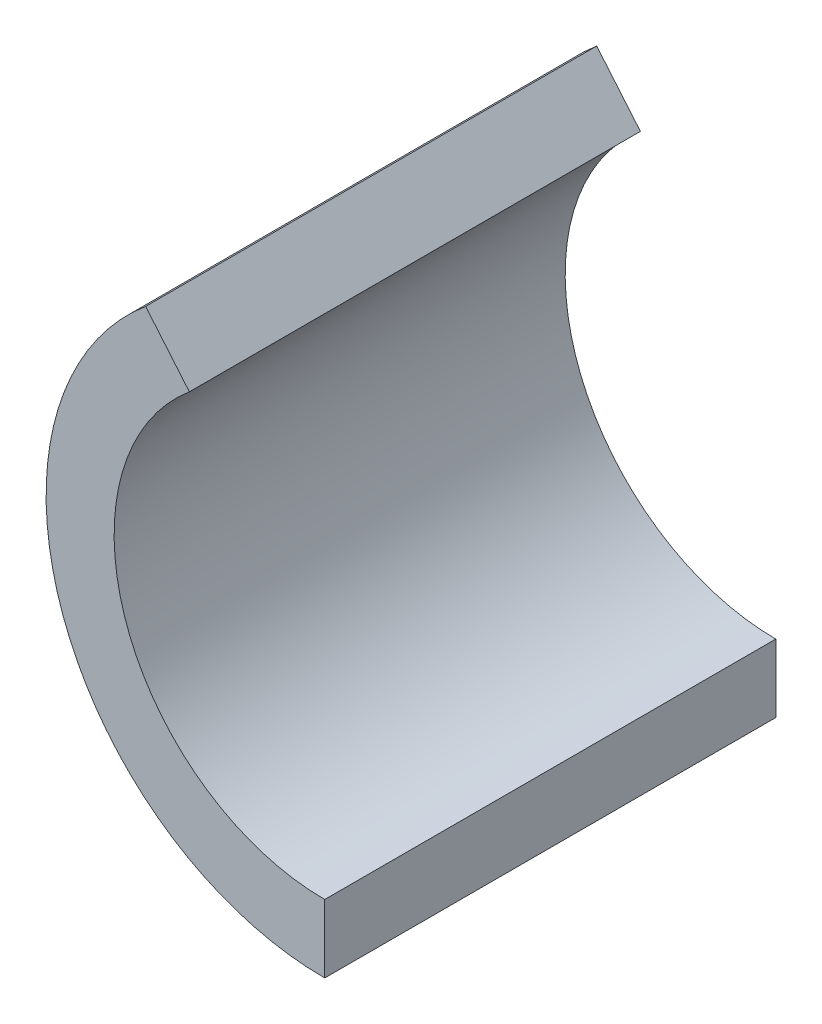
ISO-10303-21;
HEADER;
FILE_DESCRIPTION(('STEP AP214'),'2;1');
FILE_NAME('part.step','',(''),(''),'','','');
FILE_SCHEMA(('AUTOMOTIVE_DESIGN { 1 0 10303 214 1 1 1 1 }'));
ENDSEC;
DATA;
#1=APPLICATION_CONTEXT('core data for automotive mechanical design processes');
#2=APPLICATION_PROTOCOL_DEFINITION('international standard','automotive_design',2000,#1);
#3=PRODUCT_CONTEXT('',#1,'mechanical');
#4=PRODUCT('Part','Part','',(#3));
#5=PRODUCT_RELATED_PRODUCT_CATEGORY('part','',(#4));
#6=PRODUCT_DEFINITION_FORMATION('','',#4);
#7=PRODUCT_DEFINITION_CONTEXT('part definition',#1,'design');
#8=PRODUCT_DEFINITION('design','',#6,#7);
#9=PRODUCT_DEFINITION_SHAPE('','',#8);
#10=(LENGTH_UNIT() NAMED_UNIT(*) SI_UNIT(.MILLI.,.METRE.));
#11=(NAMED_UNIT(*) PLANE_ANGLE_UNIT() SI_UNIT($,.RADIAN.));
#12=(NAMED_UNIT(*) SI_UNIT($,.STERADIAN.) SOLID_ANGLE_UNIT());
#13=UNCERTAINTY_MEASURE_WITH_UNIT(LENGTH_MEASURE(1.E-05),#10,'distance_accuracy_value','');
#14=(GEOMETRIC_REPRESENTATION_CONTEXT(3) GLOBAL_UNCERTAINTY_ASSIGNED_CONTEXT((#13)) GLOBAL_UNIT_ASSIGNED_CONTEXT((#10,
#11,#12)) REPRESENTATION_CONTEXT('',''));
#15=CARTESIAN_POINT('',(0.,0.,0.));
#16=DIRECTION('',(0.,0.,1.));
#17=DIRECTION('',(1.,0.,0.));
#18=AXIS2_PLACEMENT_3D('',#15,#16,#17);
#19=CARTESIAN_POINT('',(0.,0.,-102.8));
#20=DIRECTION('',(0.,0.,1.));
#21=DIRECTION('',(-1.,0.,0.));
#22=AXIS2_PLACEMENT_3D('',#19,#20,#21);
#23=CYLINDRICAL_SURFACE('',#22,48.);
#24=CARTESIAN_POINT('',(0.,0.,0.));
#25=DIRECTION('',(0.,0.,-1.));
#26=DIRECTION('',(1.,0.,0.));
#27=AXIS2_PLACEMENT_3D('',#24,#25,#26);
#28=CIRCLE('',#27,48.);
#29=CARTESIAN_POINT('',(0.,-48.,0.));
#30=VERTEX_POINT('',#29);
#31=CARTESIAN_POINT('',(-30.8538052649537,36.7701332697112,0.));
#32=VERTEX_POINT('',#31);
#33=EDGE_CURVE('E76',#30,#32,#28,.T.);
#34=ORIENTED_EDGE('',*,*,#33,.F.);
#35=DIRECTION('',(0.,0.,1.));
#36=VECTOR('',#35,1.);
#37=CARTESIAN_POINT('',(0.,-48.,-102.8));
#38=LINE('',#37,#36);
#39=CARTESIAN_POINT('',(0.,-48.,-102.8));
#40=VERTEX_POINT('',#39);
#41=EDGE_CURVE('E82',#40,#30,#38,.T.);
#42=ORIENTED_EDGE('',*,*,#41,.F.);
#43=CARTESIAN_POINT('',(0.,0.,-102.8));
#44=DIRECTION('',(0.,0.,-1.));
#45=DIRECTION('',(1.,0.,0.));
#46=AXIS2_PLACEMENT_3D('',#43,#44,#45);
#47=CIRCLE('',#46,48.);
#48=CARTESIAN_POINT('',(-30.8538052649537,36.7701332697112,-102.8));
#49=VERTEX_POINT('',#48);
#50=EDGE_CURVE('E85',#40,#49,#47,.T.);
#51=ORIENTED_EDGE('',*,*,#50,.T.);
#52=DIRECTION('',(0.,0.,1.));
#53=VECTOR('',#52,1.);
#54=CARTESIAN_POINT('',(-30.8538052649537,36.7701332697111,-102.8));
#55=LINE('',#54,#53);
#56=EDGE_CURVE('E91',#32,#49,#55,.F.);
#57=ORIENTED_EDGE('',*,*,#56,.F.);
#58=EDGE_LOOP('',(#34,#42,#51,#57));
#59=FACE_BOUND('',#58,.T.);
#60=ADVANCED_FACE('F43',(#59),#23,.F.);
#61=CARTESIAN_POINT('',(0.,0.,-102.8));
#62=DIRECTION('',(0.,0.,1.));
#63=DIRECTION('',(-1.,0.,0.));
#64=AXIS2_PLACEMENT_3D('',#61,#62,#63);
#65=CYLINDRICAL_SURFACE('',#64,63.5);
#66=CARTESIAN_POINT('',(0.,0.,-102.8));
#67=DIRECTION('',(0.,0.,1.));
#68=DIRECTION('',(1.,0.,0.));
#69=AXIS2_PLACEMENT_3D('',#66,#67,#68);
#70=CIRCLE('',#69,63.5);
#71=CARTESIAN_POINT('',(-40.817013215095,48.6438221380553,-102.8));
#72=VERTEX_POINT('',#71);
#73=CARTESIAN_POINT('',(0.,-63.5,-102.8));
#74=VERTEX_POINT('',#73);
#75=EDGE_CURVE('E97',#72,#74,#70,.T.);
#76=ORIENTED_EDGE('',*,*,#75,.T.);
#77=DIRECTION('',(0.,0.,1.));
#78=VECTOR('',#77,1.);
#79=CARTESIAN_POINT('',(0.,-63.5,-102.8));
#80=LINE('',#79,#78);
#81=CARTESIAN_POINT('',(0.,-63.5,0.));
#82=VERTEX_POINT('',#81);
#83=EDGE_CURVE('E46',#74,#82,#80,.T.);
#84=ORIENTED_EDGE('',*,*,#83,.T.);
#85=CARTESIAN_POINT('',(0.,0.,0.));
#86=DIRECTION('',(0.,0.,1.));
#87=DIRECTION('',(1.,0.,0.));
#88=AXIS2_PLACEMENT_3D('',#85,#86,#87);
#89=CIRCLE('',#88,63.5);
#90=CARTESIAN_POINT('',(-40.817013215095,48.6438221380553,0.));
#91=VERTEX_POINT('',#90);
#92=EDGE_CURVE('E79',#91,#82,#89,.T.);
#93=ORIENTED_EDGE('',*,*,#92,.F.);
#94=DIRECTION('',(0.,0.,1.));
#95=VECTOR('',#94,1.);
#96=CARTESIAN_POINT('',(-40.817013215095,48.6438221380553,-102.8));
#97=LINE('',#96,#95);
#98=EDGE_CURVE('E92',#72,#91,#97,.T.);
#99=ORIENTED_EDGE('',*,*,#98,.F.);
#100=EDGE_LOOP('',(#76,#84,#93,#99));
#101=FACE_BOUND('',#100,.T.);
#102=ADVANCED_FACE('F117',(#101),#65,.T.);
#103=CARTESIAN_POINT('',(0.,-48.,-102.8));
#104=DIRECTION('',(-1.,0.,0.));
#105=DIRECTION('',(0.,0.,-1.));
#106=AXIS2_PLACEMENT_3D('',#103,#104,#105);
#107=PLANE('',#106);
#108=DIRECTION('',(0.,1.,0.));
#109=VECTOR('',#108,1.);
#110=CARTESIAN_POINT('',(0.,-48.,0.));
#111=LINE('',#110,#109);
#112=EDGE_CURVE('E75',#82,#30,#111,.T.);
#113=ORIENTED_EDGE('',*,*,#112,.F.);
#114=ORIENTED_EDGE('',*,*,#83,.F.);
#115=DIRECTION('',(0.,1.,0.));
#116=VECTOR('',#115,1.);
#117=CARTESIAN_POINT('',(0.,-48.,-102.8));
#118=LINE('',#117,#116);
#119=EDGE_CURVE('E65',#74,#40,#118,.T.);
#120=ORIENTED_EDGE('',*,*,#119,.T.);
#121=ORIENTED_EDGE('',*,*,#41,.T.);
#122=EDGE_LOOP('',(#113,#114,#120,#121));
#123=FACE_BOUND('',#122,.T.);
#124=ADVANCED_FACE('F86',(#123),#107,.F.);
#125=CARTESIAN_POINT('',(0.,0.,-102.8));
#126=DIRECTION('',(0.,0.,-1.));
#127=DIRECTION('',(1.,0.,0.));
#128=AXIS2_PLACEMENT_3D('',#125,#126,#127);
#129=PLANE('',#128);
#130=DIRECTION('',(0.642787609686535,-0.766044443118982,0.));
#131=VECTOR('',#130,1.);
#132=CARTESIAN_POINT('',(-75.5189668059543,90.,-102.8));
#133=LINE('',#132,#131);
#134=EDGE_CURVE('E104',#72,#49,#133,.T.);
#135=ORIENTED_EDGE('',*,*,#134,.T.);
#136=ORIENTED_EDGE('',*,*,#50,.F.);
#137=ORIENTED_EDGE('',*,*,#119,.F.);
#138=ORIENTED_EDGE('',*,*,#75,.F.);
#139=EDGE_LOOP('',(#135,#136,#137,#138));
#140=FACE_BOUND('',#139,.T.);
#141=ADVANCED_FACE('F108',(#140),#129,.T.);
#142=CARTESIAN_POINT('',(0.,0.,0.));
#143=DIRECTION('',(0.,0.,-1.));
#144=DIRECTION('',(1.,0.,0.));
#145=AXIS2_PLACEMENT_3D('',#142,#143,#144);
#146=PLANE('',#145);
#147=ORIENTED_EDGE('',*,*,#92,.T.);
#148=ORIENTED_EDGE('',*,*,#112,.T.);
#149=ORIENTED_EDGE('',*,*,#33,.T.);
#150=DIRECTION('',(0.642787609686535,-0.766044443118982,0.));
#151=VECTOR('',#150,1.);
#152=CARTESIAN_POINT('',(-75.5189668059543,90.,0.));
#153=LINE('',#152,#151);
#154=EDGE_CURVE('E11',#91,#32,#153,.T.);
#155=ORIENTED_EDGE('',*,*,#154,.F.);
#156=EDGE_LOOP('',(#147,#148,#149,#155));
#157=FACE_BOUND('',#156,.T.);
#158=ADVANCED_FACE('F78',(#157),#146,.F.);
#159=CARTESIAN_POINT('',(-75.5189668059543,90.,0.));
#160=DIRECTION('',(-0.766044443118982,-0.642787609686535,0.));
#161=DIRECTION('',(0.642787609686535,-0.766044443118982,0.));
#162=AXIS2_PLACEMENT_3D('',#159,#160,#161);
#163=PLANE('',#162);
#164=ORIENTED_EDGE('',*,*,#154,.T.);
#165=ORIENTED_EDGE('',*,*,#56,.T.);
#166=ORIENTED_EDGE('',*,*,#134,.F.);
#167=ORIENTED_EDGE('',*,*,#98,.T.);
#168=EDGE_LOOP('',(#164,#165,#166,#167));
#169=FACE_BOUND('',#168,.T.);
#170=ADVANCED_FACE('F114',(#169),#163,.F.);
#171=CLOSED_SHELL('',(#60,#102,#124,#141,#158,#170));
#172=MANIFOLD_SOLID_BREP('B2',#171);
#173=ADVANCED_BREP_SHAPE_REPRESENTATION('',(#18,#172),#14);
#174=SHAPE_DEFINITION_REPRESENTATION(#9,#173);
ENDSEC;
END-ISO-10303-21;
